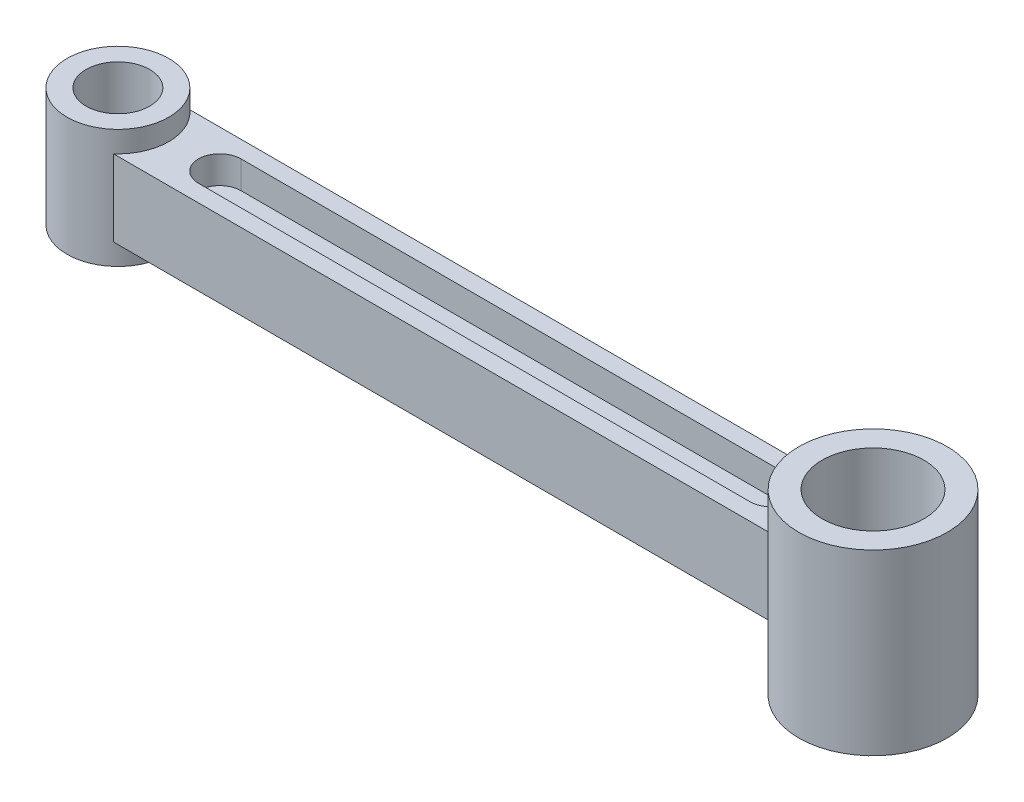
ISO-10303-21;
HEADER;
FILE_DESCRIPTION(('STEP AP214'),'2;1');
FILE_NAME('part.step','',(''),(''),'','','');
FILE_SCHEMA(('AUTOMOTIVE_DESIGN { 1 0 10303 214 1 1 1 1 }'));
ENDSEC;
DATA;
#1=APPLICATION_CONTEXT('core data for automotive mechanical design processes');
#2=APPLICATION_PROTOCOL_DEFINITION('international standard','automotive_design',2000,#1);
#3=PRODUCT_CONTEXT('',#1,'mechanical');
#4=PRODUCT('Part','Part','',(#3));
#5=PRODUCT_RELATED_PRODUCT_CATEGORY('part','',(#4));
#6=PRODUCT_DEFINITION_FORMATION('','',#4);
#7=PRODUCT_DEFINITION_CONTEXT('part definition',#1,'design');
#8=PRODUCT_DEFINITION('design','',#6,#7);
#9=PRODUCT_DEFINITION_SHAPE('','',#8);
#10=(LENGTH_UNIT() NAMED_UNIT(*) SI_UNIT(.MILLI.,.METRE.));
#11=(NAMED_UNIT(*) PLANE_ANGLE_UNIT() SI_UNIT($,.RADIAN.));
#12=(NAMED_UNIT(*) SI_UNIT($,.STERADIAN.) SOLID_ANGLE_UNIT());
#13=UNCERTAINTY_MEASURE_WITH_UNIT(LENGTH_MEASURE(1.E-05),#10,'distance_accuracy_value','');
#14=(GEOMETRIC_REPRESENTATION_CONTEXT(3) GLOBAL_UNCERTAINTY_ASSIGNED_CONTEXT((#13)) GLOBAL_UNIT_ASSIGNED_CONTEXT((#10,
#11,#12)) REPRESENTATION_CONTEXT('',''));
#15=CARTESIAN_POINT('',(0.,0.,0.));
#16=DIRECTION('',(0.,0.,1.));
#17=DIRECTION('',(1.,0.,0.));
#18=AXIS2_PLACEMENT_3D('',#15,#16,#17);
#19=CARTESIAN_POINT('',(0.,9.,0.));
#20=DIRECTION('',(0.,1.,0.));
#21=DIRECTION('',(0.,0.,1.));
#22=AXIS2_PLACEMENT_3D('',#19,#20,#21);
#23=PLANE('',#22);
#24=CARTESIAN_POINT('',(178.,9.,0.));
#25=DIRECTION('',(0.,1.,0.));
#26=DIRECTION('',(0.,0.,1.));
#27=AXIS2_PLACEMENT_3D('',#24,#25,#26);
#28=CIRCLE('',#27,17.5);
#29=CARTESIAN_POINT('',(162.991668980196,9.,-9.));
#30=VERTEX_POINT('',#29);
#31=CARTESIAN_POINT('',(162.991668980196,9.,9.));
#32=VERTEX_POINT('',#31);
#33=EDGE_CURVE('E183',#30,#32,#28,.T.);
#34=ORIENTED_EDGE('',*,*,#33,.F.);
#35=DIRECTION('',(1.,0.,0.));
#36=VECTOR('',#35,1.);
#37=CARTESIAN_POINT('',(0.,9.,-9.));
#38=LINE('',#37,#36);
#39=CARTESIAN_POINT('',(7.93725393319378,9.,-9.));
#40=VERTEX_POINT('',#39);
#41=EDGE_CURVE('E185',#40,#30,#38,.T.);
#42=ORIENTED_EDGE('',*,*,#41,.F.);
#43=CARTESIAN_POINT('',(0.,9.,0.));
#44=DIRECTION('',(0.,1.,0.));
#45=DIRECTION('',(0.,0.,1.));
#46=AXIS2_PLACEMENT_3D('',#43,#44,#45);
#47=CIRCLE('',#46,12.);
#48=CARTESIAN_POINT('',(7.93725393319378,9.,9.));
#49=VERTEX_POINT('',#48);
#50=EDGE_CURVE('E189',#49,#40,#47,.T.);
#51=ORIENTED_EDGE('',*,*,#50,.F.);
#52=DIRECTION('',(1.,0.,0.));
#53=VECTOR('',#52,1.);
#54=CARTESIAN_POINT('',(0.,9.,9.));
#55=LINE('',#54,#53);
#56=EDGE_CURVE('E191',#49,#32,#55,.T.);
#57=ORIENTED_EDGE('',*,*,#56,.T.);
#58=EDGE_LOOP('',(#34,#42,#51,#57));
#59=FACE_BOUND('',#58,.T.);
#60=DIRECTION('',(-1.,0.,0.));
#61=VECTOR('',#60,1.);
#62=CARTESIAN_POINT('',(0.,9.,5.));
#63=LINE('',#62,#61);
#64=CARTESIAN_POINT('',(154.,9.,5.));
#65=VERTEX_POINT('',#64);
#66=CARTESIAN_POINT('',(24.,9.,5.));
#67=VERTEX_POINT('',#66);
#68=EDGE_CURVE('E42',#65,#67,#63,.T.);
#69=ORIENTED_EDGE('',*,*,#68,.T.);
#70=CARTESIAN_POINT('',(24.,9.,0.));
#71=DIRECTION('',(0.,1.,0.));
#72=DIRECTION('',(0.,0.,1.));
#73=AXIS2_PLACEMENT_3D('',#70,#71,#72);
#74=CIRCLE('',#73,5.);
#75=CARTESIAN_POINT('',(24.,9.,-5.));
#76=VERTEX_POINT('',#75);
#77=EDGE_CURVE('E11',#67,#76,#74,.F.);
#78=ORIENTED_EDGE('',*,*,#77,.T.);
#79=DIRECTION('',(-1.,0.,0.));
#80=VECTOR('',#79,1.);
#81=CARTESIAN_POINT('',(0.,9.,-5.));
#82=LINE('',#81,#80);
#83=CARTESIAN_POINT('',(154.,9.,-5.));
#84=VERTEX_POINT('',#83);
#85=EDGE_CURVE('E127',#84,#76,#82,.T.);
#86=ORIENTED_EDGE('',*,*,#85,.F.);
#87=CARTESIAN_POINT('',(154.,9.,0.));
#88=DIRECTION('',(0.,1.,0.));
#89=DIRECTION('',(0.,0.,1.));
#90=AXIS2_PLACEMENT_3D('',#87,#88,#89);
#91=CIRCLE('',#90,5.);
#92=EDGE_CURVE('E238',#84,#65,#91,.F.);
#93=ORIENTED_EDGE('',*,*,#92,.T.);
#94=EDGE_LOOP('',(#69,#78,#86,#93));
#95=FACE_BOUND('',#94,.T.);
#96=ADVANCED_FACE('F34',(#59,#95),#23,.T.);
#97=CARTESIAN_POINT('',(0.,14.,0.));
#98=DIRECTION('',(0.,-1.,0.));
#99=DIRECTION('',(0.,0.,-1.));
#100=AXIS2_PLACEMENT_3D('',#97,#98,#99);
#101=CYLINDRICAL_SURFACE('',#100,7.5);
#102=CARTESIAN_POINT('',(0.,14.,0.));
#103=DIRECTION('',(0.,1.,0.));
#104=DIRECTION('',(0.,0.,1.));
#105=AXIS2_PLACEMENT_3D('',#102,#103,#104);
#106=CIRCLE('',#105,7.5);
#107=CARTESIAN_POINT('',(0.,14.,7.5));
#108=VERTEX_POINT('',#107);
#109=EDGE_CURVE('E215',#108,#108,#106,.T.);
#110=ORIENTED_EDGE('',*,*,#109,.T.);
#111=EDGE_LOOP('',(#110));
#112=FACE_BOUND('',#111,.T.);
#113=CARTESIAN_POINT('',(0.,-14.,0.));
#114=DIRECTION('',(0.,1.,0.));
#115=DIRECTION('',(0.,0.,1.));
#116=AXIS2_PLACEMENT_3D('',#113,#114,#115);
#117=CIRCLE('',#116,7.5);
#118=CARTESIAN_POINT('',(0.,-14.,7.5));
#119=VERTEX_POINT('',#118);
#120=EDGE_CURVE('E214',#119,#119,#117,.T.);
#121=ORIENTED_EDGE('',*,*,#120,.F.);
#122=EDGE_LOOP('',(#121));
#123=FACE_BOUND('',#122,.T.);
#124=ADVANCED_FACE('F36',(#112,#123),#101,.F.);
#125=CARTESIAN_POINT('',(0.,14.,0.));
#126=DIRECTION('',(0.,-1.,0.));
#127=DIRECTION('',(0.,0.,-1.));
#128=AXIS2_PLACEMENT_3D('',#125,#126,#127);
#129=CYLINDRICAL_SURFACE('',#128,12.);
#130=DIRECTION('',(0.,-1.,0.));
#131=VECTOR('',#130,1.);
#132=CARTESIAN_POINT('',(7.93725393319378,9.,9.));
#133=LINE('',#132,#131);
#134=CARTESIAN_POINT('',(7.93725393319378,-9.,9.));
#135=VERTEX_POINT('',#134);
#136=EDGE_CURVE('E206',#49,#135,#133,.T.);
#137=ORIENTED_EDGE('',*,*,#136,.F.);
#138=ORIENTED_EDGE('',*,*,#50,.T.);
#139=DIRECTION('',(0.,-1.,0.));
#140=VECTOR('',#139,1.);
#141=CARTESIAN_POINT('',(7.93725393319378,9.,-9.));
#142=LINE('',#141,#140);
#143=CARTESIAN_POINT('',(7.93725393319378,-9.,-9.));
#144=VERTEX_POINT('',#143);
#145=EDGE_CURVE('E209',#40,#144,#142,.T.);
#146=ORIENTED_EDGE('',*,*,#145,.T.);
#147=CARTESIAN_POINT('',(0.,-9.,0.));
#148=DIRECTION('',(0.,1.,0.));
#149=DIRECTION('',(0.,0.,1.));
#150=AXIS2_PLACEMENT_3D('',#147,#148,#149);
#151=CIRCLE('',#150,12.);
#152=EDGE_CURVE('E200',#135,#144,#151,.T.);
#153=ORIENTED_EDGE('',*,*,#152,.F.);
#154=EDGE_LOOP('',(#137,#138,#146,#153));
#155=FACE_BOUND('',#154,.T.);
#156=CARTESIAN_POINT('',(0.,14.,0.));
#157=DIRECTION('',(0.,1.,0.));
#158=DIRECTION('',(0.,0.,1.));
#159=AXIS2_PLACEMENT_3D('',#156,#157,#158);
#160=CIRCLE('',#159,12.);
#161=CARTESIAN_POINT('',(0.,14.,12.));
#162=VERTEX_POINT('',#161);
#163=EDGE_CURVE('E218',#162,#162,#160,.T.);
#164=ORIENTED_EDGE('',*,*,#163,.F.);
#165=EDGE_LOOP('',(#164));
#166=FACE_BOUND('',#165,.T.);
#167=CARTESIAN_POINT('',(0.,-14.,0.));
#168=DIRECTION('',(0.,1.,0.));
#169=DIRECTION('',(0.,0.,1.));
#170=AXIS2_PLACEMENT_3D('',#167,#168,#169);
#171=CIRCLE('',#170,12.);
#172=CARTESIAN_POINT('',(0.,-14.,12.));
#173=VERTEX_POINT('',#172);
#174=EDGE_CURVE('E219',#173,#173,#171,.T.);
#175=ORIENTED_EDGE('',*,*,#174,.T.);
#176=EDGE_LOOP('',(#175));
#177=FACE_BOUND('',#176,.T.);
#178=ADVANCED_FACE('F261',(#155,#166,#177),#129,.T.);
#179=CARTESIAN_POINT('',(0.,14.,0.));
#180=DIRECTION('',(0.,1.,0.));
#181=DIRECTION('',(0.,0.,1.));
#182=AXIS2_PLACEMENT_3D('',#179,#180,#181);
#183=PLANE('',#182);
#184=ORIENTED_EDGE('',*,*,#109,.F.);
#185=EDGE_LOOP('',(#184));
#186=FACE_BOUND('',#185,.T.);
#187=ORIENTED_EDGE('',*,*,#163,.T.);
#188=EDGE_LOOP('',(#187));
#189=FACE_BOUND('',#188,.T.);
#190=ADVANCED_FACE('F281',(#186,#189),#183,.T.);
#191=CARTESIAN_POINT('',(0.,-14.,0.));
#192=DIRECTION('',(0.,1.,0.));
#193=DIRECTION('',(0.,0.,1.));
#194=AXIS2_PLACEMENT_3D('',#191,#192,#193);
#195=PLANE('',#194);
#196=ORIENTED_EDGE('',*,*,#120,.T.);
#197=EDGE_LOOP('',(#196));
#198=FACE_BOUND('',#197,.T.);
#199=ORIENTED_EDGE('',*,*,#174,.F.);
#200=EDGE_LOOP('',(#199));
#201=FACE_BOUND('',#200,.T.);
#202=ADVANCED_FACE('F279',(#198,#201),#195,.F.);
#203=CARTESIAN_POINT('',(0.,9.,-9.));
#204=DIRECTION('',(0.,0.,-1.));
#205=DIRECTION('',(-1.,0.,0.));
#206=AXIS2_PLACEMENT_3D('',#203,#204,#205);
#207=PLANE('',#206);
#208=DIRECTION('',(1.,0.,0.));
#209=VECTOR('',#208,1.);
#210=CARTESIAN_POINT('',(0.,-9.,-9.));
#211=LINE('',#210,#209);
#212=CARTESIAN_POINT('',(162.991668980196,-9.,-9.00000000000001));
#213=VERTEX_POINT('',#212);
#214=EDGE_CURVE('E197',#144,#213,#211,.T.);
#215=ORIENTED_EDGE('',*,*,#214,.F.);
#216=ORIENTED_EDGE('',*,*,#145,.F.);
#217=ORIENTED_EDGE('',*,*,#41,.T.);
#218=DIRECTION('',(0.,-1.,0.));
#219=VECTOR('',#218,1.);
#220=CARTESIAN_POINT('',(162.991668980196,9.,-9.));
#221=LINE('',#220,#219);
#222=EDGE_CURVE('E211',#30,#213,#221,.T.);
#223=ORIENTED_EDGE('',*,*,#222,.T.);
#224=EDGE_LOOP('',(#215,#216,#217,#223));
#225=FACE_BOUND('',#224,.T.);
#226=ADVANCED_FACE('F275',(#225),#207,.T.);
#227=CARTESIAN_POINT('',(0.,9.,9.));
#228=DIRECTION('',(0.,0.,-1.));
#229=DIRECTION('',(-1.,0.,0.));
#230=AXIS2_PLACEMENT_3D('',#227,#228,#229);
#231=PLANE('',#230);
#232=DIRECTION('',(1.,0.,0.));
#233=VECTOR('',#232,1.);
#234=CARTESIAN_POINT('',(0.,-9.,9.));
#235=LINE('',#234,#233);
#236=CARTESIAN_POINT('',(162.991668980196,-9.,9.));
#237=VERTEX_POINT('',#236);
#238=EDGE_CURVE('E186',#135,#237,#235,.T.);
#239=ORIENTED_EDGE('',*,*,#238,.T.);
#240=DIRECTION('',(0.,-1.,0.));
#241=VECTOR('',#240,1.);
#242=CARTESIAN_POINT('',(162.991668980196,9.,9.));
#243=LINE('',#242,#241);
#244=EDGE_CURVE('E194',#32,#237,#243,.T.);
#245=ORIENTED_EDGE('',*,*,#244,.F.);
#246=ORIENTED_EDGE('',*,*,#56,.F.);
#247=ORIENTED_EDGE('',*,*,#136,.T.);
#248=EDGE_LOOP('',(#239,#245,#246,#247));
#249=FACE_BOUND('',#248,.T.);
#250=ADVANCED_FACE('F271',(#249),#231,.F.);
#251=CARTESIAN_POINT('',(0.,-9.,0.));
#252=DIRECTION('',(0.,1.,0.));
#253=DIRECTION('',(0.,0.,1.));
#254=AXIS2_PLACEMENT_3D('',#251,#252,#253);
#255=PLANE('',#254);
#256=DIRECTION('',(1.,0.,0.));
#257=VECTOR('',#256,1.);
#258=CARTESIAN_POINT('',(0.,-9.,-5.));
#259=LINE('',#258,#257);
#260=CARTESIAN_POINT('',(24.,-9.,-5.));
#261=VERTEX_POINT('',#260);
#262=CARTESIAN_POINT('',(154.,-9.,-5.));
#263=VERTEX_POINT('',#262);
#264=EDGE_CURVE('E232',#261,#263,#259,.T.);
#265=ORIENTED_EDGE('',*,*,#264,.F.);
#266=CARTESIAN_POINT('',(24.,-9.,0.));
#267=DIRECTION('',(0.,1.,0.));
#268=DIRECTION('',(0.,0.,1.));
#269=AXIS2_PLACEMENT_3D('',#266,#267,#268);
#270=CIRCLE('',#269,5.);
#271=CARTESIAN_POINT('',(24.,-9.,5.));
#272=VERTEX_POINT('',#271);
#273=EDGE_CURVE('E234',#261,#272,#270,.T.);
#274=ORIENTED_EDGE('',*,*,#273,.T.);
#275=DIRECTION('',(1.,0.,0.));
#276=VECTOR('',#275,1.);
#277=CARTESIAN_POINT('',(0.,-9.,5.));
#278=LINE('',#277,#276);
#279=CARTESIAN_POINT('',(154.,-9.,5.));
#280=VERTEX_POINT('',#279);
#281=EDGE_CURVE('E222',#272,#280,#278,.T.);
#282=ORIENTED_EDGE('',*,*,#281,.T.);
#283=CARTESIAN_POINT('',(154.,-9.,0.));
#284=DIRECTION('',(0.,1.,0.));
#285=DIRECTION('',(0.,0.,1.));
#286=AXIS2_PLACEMENT_3D('',#283,#284,#285);
#287=CIRCLE('',#286,5.);
#288=EDGE_CURVE('E229',#280,#263,#287,.T.);
#289=ORIENTED_EDGE('',*,*,#288,.T.);
#290=EDGE_LOOP('',(#265,#274,#282,#289));
#291=FACE_BOUND('',#290,.T.);
#292=CARTESIAN_POINT('',(178.,-9.,0.));
#293=DIRECTION('',(0.,1.,0.));
#294=DIRECTION('',(0.,0.,1.));
#295=AXIS2_PLACEMENT_3D('',#292,#293,#294);
#296=CIRCLE('',#295,17.5);
#297=EDGE_CURVE('E178',#213,#237,#296,.T.);
#298=ORIENTED_EDGE('',*,*,#297,.T.);
#299=ORIENTED_EDGE('',*,*,#238,.F.);
#300=ORIENTED_EDGE('',*,*,#152,.T.);
#301=ORIENTED_EDGE('',*,*,#214,.T.);
#302=EDGE_LOOP('',(#298,#299,#300,#301));
#303=FACE_BOUND('',#302,.T.);
#304=ADVANCED_FACE('F268',(#291,#303),#255,.F.);
#305=CARTESIAN_POINT('',(178.,21.,0.));
#306=DIRECTION('',(0.,-1.,0.));
#307=DIRECTION('',(0.,0.,-1.));
#308=AXIS2_PLACEMENT_3D('',#305,#306,#307);
#309=CYLINDRICAL_SURFACE('',#308,12.);
#310=CARTESIAN_POINT('',(178.,21.,0.));
#311=DIRECTION('',(0.,1.,0.));
#312=DIRECTION('',(0.,0.,1.));
#313=AXIS2_PLACEMENT_3D('',#310,#311,#312);
#314=CIRCLE('',#313,12.);
#315=CARTESIAN_POINT('',(178.,21.,12.));
#316=VERTEX_POINT('',#315);
#317=EDGE_CURVE('E171',#316,#316,#314,.T.);
#318=ORIENTED_EDGE('',*,*,#317,.T.);
#319=EDGE_LOOP('',(#318));
#320=FACE_BOUND('',#319,.T.);
#321=CARTESIAN_POINT('',(178.,-21.,0.));
#322=DIRECTION('',(0.,1.,0.));
#323=DIRECTION('',(0.,0.,1.));
#324=AXIS2_PLACEMENT_3D('',#321,#322,#323);
#325=CIRCLE('',#324,12.);
#326=CARTESIAN_POINT('',(178.,-21.,12.));
#327=VERTEX_POINT('',#326);
#328=EDGE_CURVE('E166',#327,#327,#325,.T.);
#329=ORIENTED_EDGE('',*,*,#328,.F.);
#330=EDGE_LOOP('',(#329));
#331=FACE_BOUND('',#330,.T.);
#332=ADVANCED_FACE('F266',(#320,#331),#309,.F.);
#333=CARTESIAN_POINT('',(178.,21.,0.));
#334=DIRECTION('',(0.,-1.,0.));
#335=DIRECTION('',(0.,0.,-1.));
#336=AXIS2_PLACEMENT_3D('',#333,#334,#335);
#337=CYLINDRICAL_SURFACE('',#336,17.5);
#338=ORIENTED_EDGE('',*,*,#33,.T.);
#339=ORIENTED_EDGE('',*,*,#244,.T.);
#340=ORIENTED_EDGE('',*,*,#297,.F.);
#341=ORIENTED_EDGE('',*,*,#222,.F.);
#342=EDGE_LOOP('',(#338,#339,#340,#341));
#343=FACE_BOUND('',#342,.T.);
#344=CARTESIAN_POINT('',(178.,21.,0.));
#345=DIRECTION('',(0.,1.,0.));
#346=DIRECTION('',(0.,0.,1.));
#347=AXIS2_PLACEMENT_3D('',#344,#345,#346);
#348=CIRCLE('',#347,17.5);
#349=CARTESIAN_POINT('',(178.,21.,17.5));
#350=VERTEX_POINT('',#349);
#351=EDGE_CURVE('E174',#350,#350,#348,.T.);
#352=ORIENTED_EDGE('',*,*,#351,.F.);
#353=EDGE_LOOP('',(#352));
#354=FACE_BOUND('',#353,.T.);
#355=CARTESIAN_POINT('',(178.,-21.,0.));
#356=DIRECTION('',(0.,1.,0.));
#357=DIRECTION('',(0.,0.,1.));
#358=AXIS2_PLACEMENT_3D('',#355,#356,#357);
#359=CIRCLE('',#358,17.5);
#360=CARTESIAN_POINT('',(178.,-21.,17.5));
#361=VERTEX_POINT('',#360);
#362=EDGE_CURVE('E175',#361,#361,#359,.T.);
#363=ORIENTED_EDGE('',*,*,#362,.T.);
#364=EDGE_LOOP('',(#363));
#365=FACE_BOUND('',#364,.T.);
#366=ADVANCED_FACE('F306',(#343,#354,#365),#337,.T.);
#367=CARTESIAN_POINT('',(0.,21.,0.));
#368=DIRECTION('',(0.,1.,0.));
#369=DIRECTION('',(0.,0.,1.));
#370=AXIS2_PLACEMENT_3D('',#367,#368,#369);
#371=PLANE('',#370);
#372=ORIENTED_EDGE('',*,*,#317,.F.);
#373=EDGE_LOOP('',(#372));
#374=FACE_BOUND('',#373,.T.);
#375=ORIENTED_EDGE('',*,*,#351,.T.);
#376=EDGE_LOOP('',(#375));
#377=FACE_BOUND('',#376,.T.);
#378=ADVANCED_FACE('F309',(#374,#377),#371,.T.);
#379=CARTESIAN_POINT('',(0.,-21.,0.));
#380=DIRECTION('',(0.,1.,0.));
#381=DIRECTION('',(0.,0.,1.));
#382=AXIS2_PLACEMENT_3D('',#379,#380,#381);
#383=PLANE('',#382);
#384=ORIENTED_EDGE('',*,*,#328,.T.);
#385=EDGE_LOOP('',(#384));
#386=FACE_BOUND('',#385,.T.);
#387=ORIENTED_EDGE('',*,*,#362,.F.);
#388=EDGE_LOOP('',(#387));
#389=FACE_BOUND('',#388,.T.);
#390=ADVANCED_FACE('F314',(#386,#389),#383,.F.);
#391=CARTESIAN_POINT('',(24.,-20.5,0.));
#392=DIRECTION('',(0.,1.,0.));
#393=DIRECTION('',(0.,0.,1.));
#394=AXIS2_PLACEMENT_3D('',#391,#392,#393);
#395=CYLINDRICAL_SURFACE('',#394,5.);
#396=DIRECTION('',(0.,1.,0.));
#397=VECTOR('',#396,1.);
#398=CARTESIAN_POINT('',(24.,-20.5,-5.));
#399=LINE('',#398,#397);
#400=CARTESIAN_POINT('',(24.,-2.5,-5.));
#401=VERTEX_POINT('',#400);
#402=EDGE_CURVE('E164',#261,#401,#399,.T.);
#403=ORIENTED_EDGE('',*,*,#402,.T.);
#404=CARTESIAN_POINT('',(24.,-2.5,0.));
#405=DIRECTION('',(0.,1.,0.));
#406=DIRECTION('',(0.,0.,1.));
#407=AXIS2_PLACEMENT_3D('',#404,#405,#406);
#408=CIRCLE('',#407,5.);
#409=CARTESIAN_POINT('',(24.,-2.5,5.));
#410=VERTEX_POINT('',#409);
#411=EDGE_CURVE('E149',#401,#410,#408,.T.);
#412=ORIENTED_EDGE('',*,*,#411,.T.);
#413=DIRECTION('',(0.,1.,0.));
#414=VECTOR('',#413,1.);
#415=CARTESIAN_POINT('',(24.,-20.5,5.));
#416=LINE('',#415,#414);
#417=EDGE_CURVE('E163',#272,#410,#416,.T.);
#418=ORIENTED_EDGE('',*,*,#417,.F.);
#419=ORIENTED_EDGE('',*,*,#273,.F.);
#420=EDGE_LOOP('',(#403,#412,#418,#419));
#421=FACE_BOUND('',#420,.T.);
#422=ADVANCED_FACE('F316',(#421),#395,.F.);
#423=CARTESIAN_POINT('',(24.,-20.5,-5.));
#424=DIRECTION('',(0.,0.,1.));
#425=DIRECTION('',(1.,0.,0.));
#426=AXIS2_PLACEMENT_3D('',#423,#424,#425);
#427=PLANE('',#426);
#428=ORIENTED_EDGE('',*,*,#264,.T.);
#429=DIRECTION('',(0.,1.,0.));
#430=VECTOR('',#429,1.);
#431=CARTESIAN_POINT('',(154.,-20.5,-5.));
#432=LINE('',#431,#430);
#433=CARTESIAN_POINT('',(154.,-2.5,-5.));
#434=VERTEX_POINT('',#433);
#435=EDGE_CURVE('E167',#263,#434,#432,.T.);
#436=ORIENTED_EDGE('',*,*,#435,.T.);
#437=DIRECTION('',(1.,0.,0.));
#438=VECTOR('',#437,1.);
#439=CARTESIAN_POINT('',(24.,-2.5,-5.));
#440=LINE('',#439,#438);
#441=EDGE_CURVE('E160',#401,#434,#440,.T.);
#442=ORIENTED_EDGE('',*,*,#441,.F.);
#443=ORIENTED_EDGE('',*,*,#402,.F.);
#444=EDGE_LOOP('',(#428,#436,#442,#443));
#445=FACE_BOUND('',#444,.T.);
#446=ADVANCED_FACE('F323',(#445),#427,.T.);
#447=CARTESIAN_POINT('',(154.,-20.5,0.));
#448=DIRECTION('',(0.,1.,0.));
#449=DIRECTION('',(0.,0.,1.));
#450=AXIS2_PLACEMENT_3D('',#447,#448,#449);
#451=CYLINDRICAL_SURFACE('',#450,5.);
#452=DIRECTION('',(0.,1.,0.));
#453=VECTOR('',#452,1.);
#454=CARTESIAN_POINT('',(154.,-20.5,5.));
#455=LINE('',#454,#453);
#456=CARTESIAN_POINT('',(154.,-2.5,5.));
#457=VERTEX_POINT('',#456);
#458=EDGE_CURVE('E57',#280,#457,#455,.T.);
#459=ORIENTED_EDGE('',*,*,#458,.T.);
#460=CARTESIAN_POINT('',(154.,-2.5,0.));
#461=DIRECTION('',(0.,1.,0.));
#462=DIRECTION('',(0.,0.,1.));
#463=AXIS2_PLACEMENT_3D('',#460,#461,#462);
#464=CIRCLE('',#463,5.);
#465=EDGE_CURVE('E157',#457,#434,#464,.T.);
#466=ORIENTED_EDGE('',*,*,#465,.T.);
#467=ORIENTED_EDGE('',*,*,#435,.F.);
#468=ORIENTED_EDGE('',*,*,#288,.F.);
#469=EDGE_LOOP('',(#459,#466,#467,#468));
#470=FACE_BOUND('',#469,.T.);
#471=ADVANCED_FACE('F333',(#470),#451,.F.);
#472=CARTESIAN_POINT('',(24.,-20.5,5.));
#473=DIRECTION('',(0.,0.,1.));
#474=DIRECTION('',(1.,0.,0.));
#475=AXIS2_PLACEMENT_3D('',#472,#473,#474);
#476=PLANE('',#475);
#477=ORIENTED_EDGE('',*,*,#417,.T.);
#478=DIRECTION('',(1.,0.,0.));
#479=VECTOR('',#478,1.);
#480=CARTESIAN_POINT('',(24.,-2.5,5.));
#481=LINE('',#480,#479);
#482=EDGE_CURVE('E155',#410,#457,#481,.T.);
#483=ORIENTED_EDGE('',*,*,#482,.T.);
#484=ORIENTED_EDGE('',*,*,#458,.F.);
#485=ORIENTED_EDGE('',*,*,#281,.F.);
#486=EDGE_LOOP('',(#477,#483,#484,#485));
#487=FACE_BOUND('',#486,.T.);
#488=ADVANCED_FACE('F329',(#487),#476,.F.);
#489=CARTESIAN_POINT('',(24.,-2.5,0.));
#490=DIRECTION('',(0.,1.,0.));
#491=DIRECTION('',(0.,0.,1.));
#492=AXIS2_PLACEMENT_3D('',#489,#490,#491);
#493=PLANE('',#492);
#494=ORIENTED_EDGE('',*,*,#411,.F.);
#495=ORIENTED_EDGE('',*,*,#441,.T.);
#496=ORIENTED_EDGE('',*,*,#465,.F.);
#497=ORIENTED_EDGE('',*,*,#482,.F.);
#498=EDGE_LOOP('',(#494,#495,#496,#497));
#499=FACE_BOUND('',#498,.T.);
#500=ADVANCED_FACE('F332',(#499),#493,.F.);
#501=CARTESIAN_POINT('',(24.,20.5,0.));
#502=DIRECTION('',(0.,-1.,0.));
#503=DIRECTION('',(0.,0.,-1.));
#504=AXIS2_PLACEMENT_3D('',#501,#502,#503);
#505=CYLINDRICAL_SURFACE('',#504,5.);
#506=DIRECTION('',(0.,-1.,0.));
#507=VECTOR('',#506,1.);
#508=CARTESIAN_POINT('',(24.,20.5,5.));
#509=LINE('',#508,#507);
#510=CARTESIAN_POINT('',(24.,2.5,5.));
#511=VERTEX_POINT('',#510);
#512=EDGE_CURVE('E135',#67,#511,#509,.T.);
#513=ORIENTED_EDGE('',*,*,#512,.T.);
#514=CARTESIAN_POINT('',(24.,2.5,0.));
#515=DIRECTION('',(0.,1.,0.));
#516=DIRECTION('',(0.,0.,1.));
#517=AXIS2_PLACEMENT_3D('',#514,#515,#516);
#518=CIRCLE('',#517,5.);
#519=CARTESIAN_POINT('',(24.,2.5,-5.));
#520=VERTEX_POINT('',#519);
#521=EDGE_CURVE('E132',#520,#511,#518,.T.);
#522=ORIENTED_EDGE('',*,*,#521,.F.);
#523=DIRECTION('',(0.,-1.,0.));
#524=VECTOR('',#523,1.);
#525=CARTESIAN_POINT('',(24.,20.5,-5.));
#526=LINE('',#525,#524);
#527=EDGE_CURVE('E121',#76,#520,#526,.T.);
#528=ORIENTED_EDGE('',*,*,#527,.F.);
#529=ORIENTED_EDGE('',*,*,#77,.F.);
#530=EDGE_LOOP('',(#513,#522,#528,#529));
#531=FACE_BOUND('',#530,.T.);
#532=ADVANCED_FACE('F133',(#531),#505,.F.);
#533=CARTESIAN_POINT('',(24.,20.5,5.));
#534=DIRECTION('',(0.,0.,-1.));
#535=DIRECTION('',(-1.,0.,0.));
#536=AXIS2_PLACEMENT_3D('',#533,#534,#535);
#537=PLANE('',#536);
#538=DIRECTION('',(0.,-1.,0.));
#539=VECTOR('',#538,1.);
#540=CARTESIAN_POINT('',(154.,20.5,5.));
#541=LINE('',#540,#539);
#542=CARTESIAN_POINT('',(154.,2.5,5.));
#543=VERTEX_POINT('',#542);
#544=EDGE_CURVE('E150',#65,#543,#541,.T.);
#545=ORIENTED_EDGE('',*,*,#544,.T.);
#546=DIRECTION('',(1.,0.,0.));
#547=VECTOR('',#546,1.);
#548=CARTESIAN_POINT('',(24.,2.5,5.));
#549=LINE('',#548,#547);
#550=EDGE_CURVE('E129',#511,#543,#549,.T.);
#551=ORIENTED_EDGE('',*,*,#550,.F.);
#552=ORIENTED_EDGE('',*,*,#512,.F.);
#553=ORIENTED_EDGE('',*,*,#68,.F.);
#554=EDGE_LOOP('',(#545,#551,#552,#553));
#555=FACE_BOUND('',#554,.T.);
#556=ADVANCED_FACE('F244',(#555),#537,.T.);
#557=CARTESIAN_POINT('',(154.,20.5,0.));
#558=DIRECTION('',(0.,-1.,0.));
#559=DIRECTION('',(0.,0.,-1.));
#560=AXIS2_PLACEMENT_3D('',#557,#558,#559);
#561=CYLINDRICAL_SURFACE('',#560,5.);
#562=DIRECTION('',(0.,-1.,0.));
#563=VECTOR('',#562,1.);
#564=CARTESIAN_POINT('',(154.,20.5,-5.));
#565=LINE('',#564,#563);
#566=CARTESIAN_POINT('',(154.,2.5,-5.));
#567=VERTEX_POINT('',#566);
#568=EDGE_CURVE('E49',#84,#567,#565,.T.);
#569=ORIENTED_EDGE('',*,*,#568,.T.);
#570=CARTESIAN_POINT('',(154.,2.5,0.));
#571=DIRECTION('',(0.,1.,0.));
#572=DIRECTION('',(0.,0.,1.));
#573=AXIS2_PLACEMENT_3D('',#570,#571,#572);
#574=CIRCLE('',#573,5.);
#575=EDGE_CURVE('E143',#543,#567,#574,.T.);
#576=ORIENTED_EDGE('',*,*,#575,.F.);
#577=ORIENTED_EDGE('',*,*,#544,.F.);
#578=ORIENTED_EDGE('',*,*,#92,.F.);
#579=EDGE_LOOP('',(#569,#576,#577,#578));
#580=FACE_BOUND('',#579,.T.);
#581=ADVANCED_FACE('F246',(#580),#561,.F.);
#582=CARTESIAN_POINT('',(24.,20.5,-5.));
#583=DIRECTION('',(0.,0.,-1.));
#584=DIRECTION('',(-1.,0.,0.));
#585=AXIS2_PLACEMENT_3D('',#582,#583,#584);
#586=PLANE('',#585);
#587=ORIENTED_EDGE('',*,*,#85,.T.);
#588=ORIENTED_EDGE('',*,*,#527,.T.);
#589=DIRECTION('',(1.,0.,0.));
#590=VECTOR('',#589,1.);
#591=CARTESIAN_POINT('',(24.,2.5,-5.));
#592=LINE('',#591,#590);
#593=EDGE_CURVE('E125',#520,#567,#592,.T.);
#594=ORIENTED_EDGE('',*,*,#593,.T.);
#595=ORIENTED_EDGE('',*,*,#568,.F.);
#596=EDGE_LOOP('',(#587,#588,#594,#595));
#597=FACE_BOUND('',#596,.T.);
#598=ADVANCED_FACE('F123',(#597),#586,.F.);
#599=CARTESIAN_POINT('',(24.,2.5,0.));
#600=DIRECTION('',(0.,-1.,0.));
#601=DIRECTION('',(0.,0.,1.));
#602=AXIS2_PLACEMENT_3D('',#599,#600,#601);
#603=PLANE('',#602);
#604=ORIENTED_EDGE('',*,*,#521,.T.);
#605=ORIENTED_EDGE('',*,*,#550,.T.);
#606=ORIENTED_EDGE('',*,*,#575,.T.);
#607=ORIENTED_EDGE('',*,*,#593,.F.);
#608=EDGE_LOOP('',(#604,#605,#606,#607));
#609=FACE_BOUND('',#608,.T.);
#610=ADVANCED_FACE('F141',(#609),#603,.F.);
#611=CLOSED_SHELL('',(#96,#124,#178,#190,#202,#226,#250,#304,#332,#366,#378,#390,#422,#446,#471,
#488,#500,#532,#556,#581,#598,#610));
#612=MANIFOLD_SOLID_BREP('B2',#611);
#613=ADVANCED_BREP_SHAPE_REPRESENTATION('',(#18,#612),#14);
#614=SHAPE_DEFINITION_REPRESENTATION(#9,#613);
ENDSEC;
END-ISO-10303-21;
